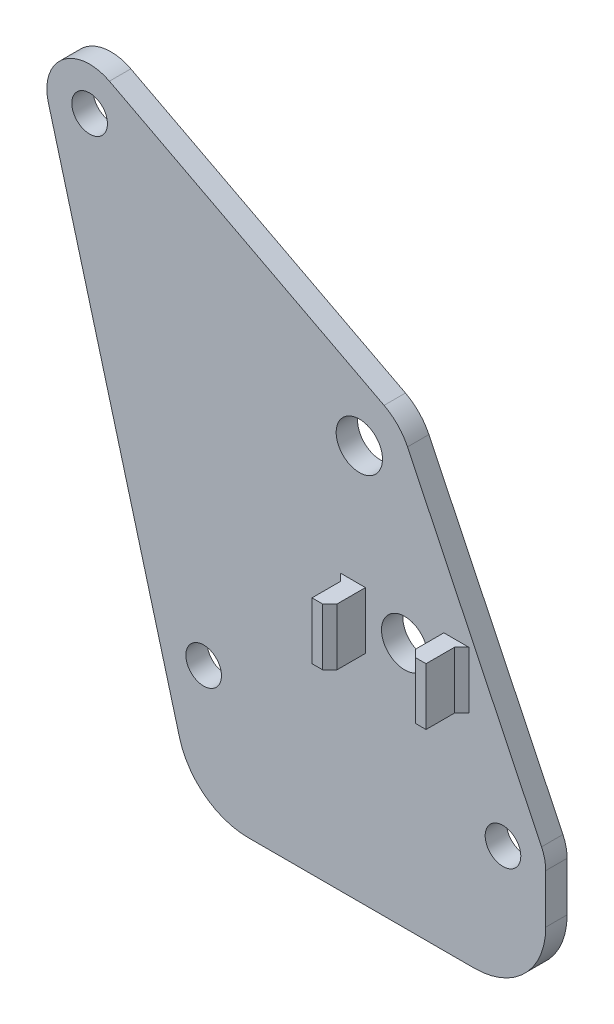
ISO-10303-21;
HEADER;
FILE_DESCRIPTION(('STEP AP214'),'2;1');
FILE_NAME('part.step','',(''),(''),'','','');
FILE_SCHEMA(('AUTOMOTIVE_DESIGN { 1 0 10303 214 1 1 1 1 }'));
ENDSEC;
DATA;
#1=APPLICATION_CONTEXT('core data for automotive mechanical design processes');
#2=APPLICATION_PROTOCOL_DEFINITION('international standard','automotive_design',2000,#1);
#3=PRODUCT_CONTEXT('',#1,'mechanical');
#4=PRODUCT('Part','Part','',(#3));
#5=PRODUCT_RELATED_PRODUCT_CATEGORY('part','',(#4));
#6=PRODUCT_DEFINITION_FORMATION('','',#4);
#7=PRODUCT_DEFINITION_CONTEXT('part definition',#1,'design');
#8=PRODUCT_DEFINITION('design','',#6,#7);
#9=PRODUCT_DEFINITION_SHAPE('','',#8);
#10=(LENGTH_UNIT() NAMED_UNIT(*) SI_UNIT(.MILLI.,.METRE.));
#11=(NAMED_UNIT(*) PLANE_ANGLE_UNIT() SI_UNIT($,.RADIAN.));
#12=(NAMED_UNIT(*) SI_UNIT($,.STERADIAN.) SOLID_ANGLE_UNIT());
#13=UNCERTAINTY_MEASURE_WITH_UNIT(LENGTH_MEASURE(1.E-05),#10,'distance_accuracy_value','');
#14=(GEOMETRIC_REPRESENTATION_CONTEXT(3) GLOBAL_UNCERTAINTY_ASSIGNED_CONTEXT((#13)) GLOBAL_UNIT_ASSIGNED_CONTEXT((#10,
#11,#12)) REPRESENTATION_CONTEXT('',''));
#15=CARTESIAN_POINT('',(0.,0.,0.));
#16=DIRECTION('',(0.,0.,1.));
#17=DIRECTION('',(1.,0.,0.));
#18=AXIS2_PLACEMENT_3D('',#15,#16,#17);
#19=CARTESIAN_POINT('',(-58.,60.,3.));
#20=DIRECTION('',(0.,0.,-1.));
#21=DIRECTION('',(-1.,0.,0.));
#22=AXIS2_PLACEMENT_3D('',#19,#20,#21);
#23=PLANE('',#22);
#24=DIRECTION('',(-1.,0.,0.));
#25=VECTOR('',#24,1.);
#26=CARTESIAN_POINT('',(-8.29852756095151,21.7480131570888,3.));
#27=LINE('',#26,#25);
#28=CARTESIAN_POINT('',(-4.79852756095151,21.7480131570888,3.));
#29=VERTEX_POINT('',#28);
#30=CARTESIAN_POINT('',(-8.29852756095151,21.7480131570888,3.));
#31=VERTEX_POINT('',#30);
#32=EDGE_CURVE('E223',#29,#31,#27,.T.);
#33=ORIENTED_EDGE('',*,*,#32,.F.);
#34=DIRECTION('',(0.,-1.,0.));
#35=VECTOR('',#34,1.);
#36=CARTESIAN_POINT('',(-4.79852756095151,13.7480131570888,3.));
#37=LINE('',#36,#35);
#38=CARTESIAN_POINT('',(-4.79852756095151,13.7480131570888,3.));
#39=VERTEX_POINT('',#38);
#40=EDGE_CURVE('E402',#29,#39,#37,.T.);
#41=ORIENTED_EDGE('',*,*,#40,.T.);
#42=DIRECTION('',(1.,0.,0.));
#43=VECTOR('',#42,1.);
#44=CARTESIAN_POINT('',(-5.79852756095151,13.7480131570888,3.));
#45=LINE('',#44,#43);
#46=CARTESIAN_POINT('',(-8.29852756095151,13.7480131570888,3.));
#47=VERTEX_POINT('',#46);
#48=EDGE_CURVE('E219',#47,#39,#45,.T.);
#49=ORIENTED_EDGE('',*,*,#48,.F.);
#50=DIRECTION('',(0.,-1.,0.));
#51=VECTOR('',#50,1.);
#52=CARTESIAN_POINT('',(-8.29852756095151,21.7480131570888,3.));
#53=LINE('',#52,#51);
#54=EDGE_CURVE('E233',#31,#47,#53,.T.);
#55=ORIENTED_EDGE('',*,*,#54,.F.);
#56=EDGE_LOOP('',(#33,#41,#49,#55));
#57=FACE_BOUND('',#56,.T.);
#58=DIRECTION('',(0.261440011704001,-0.965219726425135,0.));
#59=VECTOR('',#58,1.);
#60=CARTESIAN_POINT('',(-63.7913183585508,58.431359929776,3.));
#61=LINE('',#60,#59);
#62=CARTESIAN_POINT('',(-63.7913183585508,58.431359929776,3.));
#63=VERTEX_POINT('',#62);
#64=CARTESIAN_POINT('',(-45.396059940861,-9.48275230467717,3.));
#65=VERTEX_POINT('',#64);
#66=EDGE_CURVE('E305',#63,#65,#61,.T.);
#67=ORIENTED_EDGE('',*,*,#66,.T.);
#68=CARTESIAN_POINT('',(-35.7438626766096,-6.86835218763717,3.));
#69=DIRECTION('',(0.,0.,-1.));
#70=DIRECTION('',(-1.,0.,0.));
#71=AXIS2_PLACEMENT_3D('',#68,#69,#70);
#72=CIRCLE('',#71,10.);
#73=CARTESIAN_POINT('',(-35.7438626766096,-16.8683521876372,3.));
#74=VERTEX_POINT('',#73);
#75=EDGE_CURVE('E47',#65,#74,#72,.F.);
#76=ORIENTED_EDGE('',*,*,#75,.T.);
#77=DIRECTION('',(1.,0.,0.));
#78=VECTOR('',#77,1.);
#79=CARTESIAN_POINT('',(-43.3955917915065,-16.8683521876372,3.));
#80=LINE('',#79,#78);
#81=CARTESIAN_POINT('',(-4.,-16.8683521876372,3.));
#82=VERTEX_POINT('',#81);
#83=EDGE_CURVE('E309',#74,#82,#80,.T.);
#84=ORIENTED_EDGE('',*,*,#83,.T.);
#85=CARTESIAN_POINT('',(-4.,-6.86835218763716,3.));
#86=DIRECTION('',(0.,0.,-1.));
#87=DIRECTION('',(-1.,0.,0.));
#88=AXIS2_PLACEMENT_3D('',#85,#86,#87);
#89=CIRCLE('',#88,10.);
#90=CARTESIAN_POINT('',(6.,-6.86835218763716,3.));
#91=VERTEX_POINT('',#90);
#92=EDGE_CURVE('E54',#82,#91,#89,.F.);
#93=ORIENTED_EDGE('',*,*,#92,.T.);
#94=DIRECTION('',(0.,1.,0.));
#95=VECTOR('',#94,1.);
#96=CARTESIAN_POINT('',(6.,0.,3.));
#97=LINE('',#96,#95);
#98=CARTESIAN_POINT('',(6.,0.,3.));
#99=VERTEX_POINT('',#98);
#100=EDGE_CURVE('E312',#91,#99,#97,.T.);
#101=ORIENTED_EDGE('',*,*,#100,.T.);
#102=CARTESIAN_POINT('',(0.,0.,3.));
#103=DIRECTION('',(0.,0.,1.));
#104=DIRECTION('',(-1.,0.,0.));
#105=AXIS2_PLACEMENT_3D('',#102,#103,#104);
#106=CIRCLE('',#105,6.);
#107=CARTESIAN_POINT('',(5.4096285675306,2.59536486093127,3.));
#108=VERTEX_POINT('',#107);
#109=EDGE_CURVE('E315',#99,#108,#106,.T.);
#110=ORIENTED_EDGE('',*,*,#109,.T.);
#111=DIRECTION('',(-0.432560810155212,0.9016047612551,0.));
#112=VECTOR('',#111,1.);
#113=CARTESIAN_POINT('',(-13.3955764292577,41.7918476754489,3.));
#114=LINE('',#113,#112);
#115=CARTESIAN_POINT('',(-13.3955764292577,41.7918476754489,3.));
#116=VERTEX_POINT('',#115);
#117=EDGE_CURVE('E318',#108,#116,#114,.T.);
#118=ORIENTED_EDGE('',*,*,#117,.T.);
#119=CARTESIAN_POINT('',(-20.157612138671,38.5476415992848,3.));
#120=DIRECTION('',(0.,0.,1.));
#121=DIRECTION('',(-1.,0.,0.));
#122=AXIS2_PLACEMENT_3D('',#119,#120,#121);
#123=CIRCLE('',#122,7.5);
#124=CARTESIAN_POINT('',(-16.6861137587854,45.195851809443,3.));
#125=VERTEX_POINT('',#124);
#126=EDGE_CURVE('E321',#116,#125,#123,.T.);
#127=ORIENTED_EDGE('',*,*,#126,.T.);
#128=DIRECTION('',(-0.88642802802109,0.462866450651418,0.));
#129=VECTOR('',#128,1.);
#130=CARTESIAN_POINT('',(-55.2228012960915,65.3185681681265,3.));
#131=LINE('',#130,#129);
#132=CARTESIAN_POINT('',(-55.2228012960915,65.3185681681265,3.));
#133=VERTEX_POINT('',#132);
#134=EDGE_CURVE('E324',#125,#133,#131,.T.);
#135=ORIENTED_EDGE('',*,*,#134,.T.);
#136=CARTESIAN_POINT('',(-58.,60.,3.));
#137=DIRECTION('',(0.,0.,1.));
#138=DIRECTION('',(-1.,0.,0.));
#139=AXIS2_PLACEMENT_3D('',#136,#137,#138);
#140=CIRCLE('',#139,6.);
#141=EDGE_CURVE('E301',#133,#63,#140,.T.);
#142=ORIENTED_EDGE('',*,*,#141,.T.);
#143=EDGE_LOOP('',(#67,#76,#84,#93,#101,#110,#118,#127,#135,#142));
#144=FACE_BOUND('',#143,.T.);
#145=CARTESIAN_POINT('',(0.,0.,3.));
#146=DIRECTION('',(0.,0.,1.));
#147=DIRECTION('',(1.,0.,0.));
#148=AXIS2_PLACEMENT_3D('',#145,#146,#147);
#149=CIRCLE('',#148,2.5);
#150=CARTESIAN_POINT('',(2.5,0.,3.));
#151=VERTEX_POINT('',#150);
#152=EDGE_CURVE('E293',#151,#151,#149,.T.);
#153=ORIENTED_EDGE('',*,*,#152,.F.);
#154=EDGE_LOOP('',(#153));
#155=FACE_BOUND('',#154,.T.);
#156=CARTESIAN_POINT('',(-58.,60.,3.));
#157=DIRECTION('',(0.,0.,1.));
#158=DIRECTION('',(1.,0.,0.));
#159=AXIS2_PLACEMENT_3D('',#156,#157,#158);
#160=CIRCLE('',#159,2.50000000000001);
#161=CARTESIAN_POINT('',(-55.5,60.,3.));
#162=VERTEX_POINT('',#161);
#163=EDGE_CURVE('E285',#162,#162,#160,.T.);
#164=ORIENTED_EDGE('',*,*,#163,.F.);
#165=EDGE_LOOP('',(#164));
#166=FACE_BOUND('',#165,.T.);
#167=CARTESIAN_POINT('',(-41.9999999999999,0.9290279550359,3.));
#168=DIRECTION('',(0.,0.,1.));
#169=DIRECTION('',(1.,0.,0.));
#170=AXIS2_PLACEMENT_3D('',#167,#168,#169);
#171=CIRCLE('',#170,2.49999999999987);
#172=CARTESIAN_POINT('',(-39.5000000000001,0.9290279550359,3.));
#173=VERTEX_POINT('',#172);
#174=EDGE_CURVE('E277',#173,#173,#171,.T.);
#175=ORIENTED_EDGE('',*,*,#174,.F.);
#176=EDGE_LOOP('',(#175));
#177=FACE_BOUND('',#176,.T.);
#178=CARTESIAN_POINT('',(-20.157612138671,38.5476415992848,3.));
#179=DIRECTION('',(0.,0.,1.));
#180=DIRECTION('',(1.,0.,0.));
#181=AXIS2_PLACEMENT_3D('',#178,#179,#180);
#182=CIRCLE('',#181,3.24999999999987);
#183=CARTESIAN_POINT('',(-16.9076121386711,38.5476415992848,3.));
#184=VERTEX_POINT('',#183);
#185=EDGE_CURVE('E269',#184,#184,#182,.T.);
#186=ORIENTED_EDGE('',*,*,#185,.F.);
#187=EDGE_LOOP('',(#186));
#188=FACE_BOUND('',#187,.T.);
#189=CARTESIAN_POINT('',(-13.7985275609515,17.7480131570888,3.));
#190=DIRECTION('',(0.,0.,1.));
#191=DIRECTION('',(1.,0.,0.));
#192=AXIS2_PLACEMENT_3D('',#189,#190,#191);
#193=CIRCLE('',#192,3.24999999999987);
#194=CARTESIAN_POINT('',(-10.5485275609516,17.7480131570888,3.));
#195=VERTEX_POINT('',#194);
#196=EDGE_CURVE('E261',#195,#195,#193,.T.);
#197=ORIENTED_EDGE('',*,*,#196,.F.);
#198=EDGE_LOOP('',(#197));
#199=FACE_BOUND('',#198,.T.);
#200=DIRECTION('',(1.,0.,0.));
#201=VECTOR('',#200,1.);
#202=CARTESIAN_POINT('',(-19.2985275609515,13.7480131570888,3.));
#203=LINE('',#202,#201);
#204=CARTESIAN_POINT('',(-22.7985275609515,13.7480131570888,3.));
#205=VERTEX_POINT('',#204);
#206=CARTESIAN_POINT('',(-19.2985275609515,13.7480131570888,3.));
#207=VERTEX_POINT('',#206);
#208=EDGE_CURVE('E607',#205,#207,#203,.T.);
#209=ORIENTED_EDGE('',*,*,#208,.F.);
#210=DIRECTION('',(0.,1.,0.));
#211=VECTOR('',#210,1.);
#212=CARTESIAN_POINT('',(-22.7985275609515,21.7480131570888,3.));
#213=LINE('',#212,#211);
#214=CARTESIAN_POINT('',(-22.7985275609515,21.7480131570888,3.));
#215=VERTEX_POINT('',#214);
#216=EDGE_CURVE('E406',#205,#215,#213,.T.);
#217=ORIENTED_EDGE('',*,*,#216,.T.);
#218=DIRECTION('',(-1.,0.,0.));
#219=VECTOR('',#218,1.);
#220=CARTESIAN_POINT('',(-21.7985275609515,21.7480131570888,3.));
#221=LINE('',#220,#219);
#222=CARTESIAN_POINT('',(-19.2985275609515,21.7480131570888,3.));
#223=VERTEX_POINT('',#222);
#224=EDGE_CURVE('E614',#223,#215,#221,.T.);
#225=ORIENTED_EDGE('',*,*,#224,.F.);
#226=DIRECTION('',(0.,1.,0.));
#227=VECTOR('',#226,1.);
#228=CARTESIAN_POINT('',(-19.2985275609515,21.7480131570888,3.));
#229=LINE('',#228,#227);
#230=EDGE_CURVE('E201',#207,#223,#229,.T.);
#231=ORIENTED_EDGE('',*,*,#230,.F.);
#232=EDGE_LOOP('',(#209,#217,#225,#231));
#233=FACE_BOUND('',#232,.T.);
#234=ADVANCED_FACE('F38',(#57,#144,#155,#166,#177,#188,#199,#233),#23,.F.);
#235=CARTESIAN_POINT('',(-58.,60.,0.));
#236=DIRECTION('',(0.,0.,-1.));
#237=DIRECTION('',(-1.,0.,0.));
#238=AXIS2_PLACEMENT_3D('',#235,#236,#237);
#239=PLANE('',#238);
#240=CARTESIAN_POINT('',(-20.157612138671,38.5476415992848,0.));
#241=DIRECTION('',(0.,0.,1.));
#242=DIRECTION('',(1.,0.,0.));
#243=AXIS2_PLACEMENT_3D('',#240,#241,#242);
#244=CIRCLE('',#243,3.24999999999987);
#245=CARTESIAN_POINT('',(-16.9076121386711,38.5476415992848,0.));
#246=VERTEX_POINT('',#245);
#247=EDGE_CURVE('E265',#246,#246,#244,.T.);
#248=ORIENTED_EDGE('',*,*,#247,.T.);
#249=EDGE_LOOP('',(#248));
#250=FACE_BOUND('',#249,.T.);
#251=CARTESIAN_POINT('',(-58.,60.,0.));
#252=DIRECTION('',(0.,0.,1.));
#253=DIRECTION('',(1.,0.,0.));
#254=AXIS2_PLACEMENT_3D('',#251,#252,#253);
#255=CIRCLE('',#254,2.50000000000001);
#256=CARTESIAN_POINT('',(-55.5,60.,0.));
#257=VERTEX_POINT('',#256);
#258=EDGE_CURVE('E281',#257,#257,#255,.T.);
#259=ORIENTED_EDGE('',*,*,#258,.T.);
#260=EDGE_LOOP('',(#259));
#261=FACE_BOUND('',#260,.T.);
#262=DIRECTION('',(1.,0.,0.));
#263=VECTOR('',#262,1.);
#264=CARTESIAN_POINT('',(-43.3955917915065,-16.8683521876372,0.));
#265=LINE('',#264,#263);
#266=CARTESIAN_POINT('',(-35.7438626766096,-16.8683521876372,0.));
#267=VERTEX_POINT('',#266);
#268=CARTESIAN_POINT('',(-4.,-16.8683521876372,0.));
#269=VERTEX_POINT('',#268);
#270=EDGE_CURVE('E334',#267,#269,#265,.T.);
#271=ORIENTED_EDGE('',*,*,#270,.F.);
#272=CARTESIAN_POINT('',(-35.7438626766096,-6.86835218763717,0.));
#273=DIRECTION('',(0.,0.,-1.));
#274=DIRECTION('',(-1.,0.,0.));
#275=AXIS2_PLACEMENT_3D('',#272,#273,#274);
#276=CIRCLE('',#275,10.);
#277=CARTESIAN_POINT('',(-45.396059940861,-9.48275230467717,0.));
#278=VERTEX_POINT('',#277);
#279=EDGE_CURVE('E437',#267,#278,#276,.T.);
#280=ORIENTED_EDGE('',*,*,#279,.T.);
#281=DIRECTION('',(0.261440011704001,-0.965219726425135,0.));
#282=VECTOR('',#281,1.);
#283=CARTESIAN_POINT('',(-63.7913183585508,58.431359929776,0.));
#284=LINE('',#283,#282);
#285=CARTESIAN_POINT('',(-63.7913183585508,58.431359929776,0.));
#286=VERTEX_POINT('',#285);
#287=EDGE_CURVE('E331',#286,#278,#284,.T.);
#288=ORIENTED_EDGE('',*,*,#287,.F.);
#289=CARTESIAN_POINT('',(-58.,60.,0.));
#290=DIRECTION('',(0.,0.,1.));
#291=DIRECTION('',(-1.,0.,0.));
#292=AXIS2_PLACEMENT_3D('',#289,#290,#291);
#293=CIRCLE('',#292,6.);
#294=CARTESIAN_POINT('',(-55.2228012960915,65.3185681681265,0.));
#295=VERTEX_POINT('',#294);
#296=EDGE_CURVE('E297',#295,#286,#293,.T.);
#297=ORIENTED_EDGE('',*,*,#296,.F.);
#298=DIRECTION('',(-0.88642802802109,0.462866450651418,0.));
#299=VECTOR('',#298,1.);
#300=CARTESIAN_POINT('',(-55.2228012960915,65.3185681681265,0.));
#301=LINE('',#300,#299);
#302=CARTESIAN_POINT('',(-16.6861137587854,45.195851809443,0.));
#303=VERTEX_POINT('',#302);
#304=EDGE_CURVE('E306',#303,#295,#301,.T.);
#305=ORIENTED_EDGE('',*,*,#304,.F.);
#306=CARTESIAN_POINT('',(-20.157612138671,38.5476415992848,0.));
#307=DIRECTION('',(0.,0.,1.));
#308=DIRECTION('',(-1.,0.,0.));
#309=AXIS2_PLACEMENT_3D('',#306,#307,#308);
#310=CIRCLE('',#309,7.5);
#311=CARTESIAN_POINT('',(-13.3955764292577,41.7918476754489,0.));
#312=VERTEX_POINT('',#311);
#313=EDGE_CURVE('E347',#312,#303,#310,.T.);
#314=ORIENTED_EDGE('',*,*,#313,.F.);
#315=DIRECTION('',(-0.432560810155212,0.9016047612551,0.));
#316=VECTOR('',#315,1.);
#317=CARTESIAN_POINT('',(-13.3955764292577,41.7918476754489,0.));
#318=LINE('',#317,#316);
#319=CARTESIAN_POINT('',(5.4096285675306,2.59536486093127,0.));
#320=VERTEX_POINT('',#319);
#321=EDGE_CURVE('E344',#320,#312,#318,.T.);
#322=ORIENTED_EDGE('',*,*,#321,.F.);
#323=CARTESIAN_POINT('',(0.,0.,0.));
#324=DIRECTION('',(0.,0.,1.));
#325=DIRECTION('',(-1.,0.,0.));
#326=AXIS2_PLACEMENT_3D('',#323,#324,#325);
#327=CIRCLE('',#326,6.);
#328=CARTESIAN_POINT('',(6.,0.,0.));
#329=VERTEX_POINT('',#328);
#330=EDGE_CURVE('E341',#329,#320,#327,.T.);
#331=ORIENTED_EDGE('',*,*,#330,.F.);
#332=DIRECTION('',(0.,1.,0.));
#333=VECTOR('',#332,1.);
#334=CARTESIAN_POINT('',(6.,0.,0.));
#335=LINE('',#334,#333);
#336=CARTESIAN_POINT('',(6.,-6.86835218763716,0.));
#337=VERTEX_POINT('',#336);
#338=EDGE_CURVE('E338',#337,#329,#335,.T.);
#339=ORIENTED_EDGE('',*,*,#338,.F.);
#340=CARTESIAN_POINT('',(-4.,-6.86835218763716,0.));
#341=DIRECTION('',(0.,0.,-1.));
#342=DIRECTION('',(-1.,0.,0.));
#343=AXIS2_PLACEMENT_3D('',#340,#341,#342);
#344=CIRCLE('',#343,10.);
#345=EDGE_CURVE('E434',#337,#269,#344,.T.);
#346=ORIENTED_EDGE('',*,*,#345,.T.);
#347=EDGE_LOOP('',(#271,#280,#288,#297,#305,#314,#322,#331,#339,#346));
#348=FACE_BOUND('',#347,.T.);
#349=CARTESIAN_POINT('',(0.,0.,0.));
#350=DIRECTION('',(0.,0.,1.));
#351=DIRECTION('',(1.,0.,0.));
#352=AXIS2_PLACEMENT_3D('',#349,#350,#351);
#353=CIRCLE('',#352,2.5);
#354=CARTESIAN_POINT('',(2.5,0.,0.));
#355=VERTEX_POINT('',#354);
#356=EDGE_CURVE('E289',#355,#355,#353,.T.);
#357=ORIENTED_EDGE('',*,*,#356,.T.);
#358=EDGE_LOOP('',(#357));
#359=FACE_BOUND('',#358,.T.);
#360=CARTESIAN_POINT('',(-41.9999999999999,0.9290279550359,0.));
#361=DIRECTION('',(0.,0.,1.));
#362=DIRECTION('',(1.,0.,0.));
#363=AXIS2_PLACEMENT_3D('',#360,#361,#362);
#364=CIRCLE('',#363,2.49999999999987);
#365=CARTESIAN_POINT('',(-39.5000000000001,0.9290279550359,0.));
#366=VERTEX_POINT('',#365);
#367=EDGE_CURVE('E273',#366,#366,#364,.T.);
#368=ORIENTED_EDGE('',*,*,#367,.T.);
#369=EDGE_LOOP('',(#368));
#370=FACE_BOUND('',#369,.T.);
#371=CARTESIAN_POINT('',(-13.7985275609515,17.7480131570888,0.));
#372=DIRECTION('',(0.,0.,1.));
#373=DIRECTION('',(1.,0.,0.));
#374=AXIS2_PLACEMENT_3D('',#371,#372,#373);
#375=CIRCLE('',#374,3.24999999999987);
#376=CARTESIAN_POINT('',(-10.5485275609516,17.7480131570888,0.));
#377=VERTEX_POINT('',#376);
#378=EDGE_CURVE('E260',#377,#377,#375,.T.);
#379=ORIENTED_EDGE('',*,*,#378,.T.);
#380=EDGE_LOOP('',(#379));
#381=FACE_BOUND('',#380,.T.);
#382=ADVANCED_FACE('F455',(#250,#261,#348,#359,#370,#381),#239,.T.);
#383=CARTESIAN_POINT('',(-58.,60.,3.));
#384=DIRECTION('',(0.,0.,-1.));
#385=DIRECTION('',(-1.,0.,0.));
#386=AXIS2_PLACEMENT_3D('',#383,#384,#385);
#387=CYLINDRICAL_SURFACE('',#386,6.);
#388=ORIENTED_EDGE('',*,*,#296,.T.);
#389=DIRECTION('',(0.,0.,-1.));
#390=VECTOR('',#389,1.);
#391=CARTESIAN_POINT('',(-63.7913183585508,58.431359929776,3.));
#392=LINE('',#391,#390);
#393=EDGE_CURVE('E371',#63,#286,#392,.T.);
#394=ORIENTED_EDGE('',*,*,#393,.F.);
#395=ORIENTED_EDGE('',*,*,#141,.F.);
#396=DIRECTION('',(0.,0.,-1.));
#397=VECTOR('',#396,1.);
#398=CARTESIAN_POINT('',(-55.2228012960915,65.3185681681265,3.));
#399=LINE('',#398,#397);
#400=EDGE_CURVE('E327',#133,#295,#399,.T.);
#401=ORIENTED_EDGE('',*,*,#400,.T.);
#402=EDGE_LOOP('',(#388,#394,#395,#401));
#403=FACE_BOUND('',#402,.T.);
#404=ADVANCED_FACE('F462',(#403),#387,.T.);
#405=CARTESIAN_POINT('',(-63.7913183585508,58.431359929776,3.));
#406=DIRECTION('',(0.965219726425135,0.261440011704001,0.));
#407=DIRECTION('',(-0.261440011704001,0.965219726425135,0.));
#408=AXIS2_PLACEMENT_3D('',#405,#406,#407);
#409=PLANE('',#408);
#410=ORIENTED_EDGE('',*,*,#287,.T.);
#411=DIRECTION('',(0.,0.,-1.));
#412=VECTOR('',#411,1.);
#413=CARTESIAN_POINT('',(-45.396059940861,-9.48275230467717,3.));
#414=LINE('',#413,#412);
#415=EDGE_CURVE('E62',#278,#65,#414,.F.);
#416=ORIENTED_EDGE('',*,*,#415,.T.);
#417=ORIENTED_EDGE('',*,*,#66,.F.);
#418=ORIENTED_EDGE('',*,*,#393,.T.);
#419=EDGE_LOOP('',(#410,#416,#417,#418));
#420=FACE_BOUND('',#419,.T.);
#421=ADVANCED_FACE('F458',(#420),#409,.F.);
#422=CARTESIAN_POINT('',(-43.3955917915065,-16.8683521876372,3.));
#423=DIRECTION('',(0.,1.,0.));
#424=DIRECTION('',(-1.,0.,0.));
#425=AXIS2_PLACEMENT_3D('',#422,#423,#424);
#426=PLANE('',#425);
#427=ORIENTED_EDGE('',*,*,#83,.F.);
#428=DIRECTION('',(0.,0.,-1.));
#429=VECTOR('',#428,1.);
#430=CARTESIAN_POINT('',(-35.7438626766096,-16.8683521876372,3.));
#431=LINE('',#430,#429);
#432=EDGE_CURVE('E430',#74,#267,#431,.T.);
#433=ORIENTED_EDGE('',*,*,#432,.T.);
#434=ORIENTED_EDGE('',*,*,#270,.T.);
#435=DIRECTION('',(0.,0.,-1.));
#436=VECTOR('',#435,1.);
#437=CARTESIAN_POINT('',(-4.,-16.8683521876372,3.));
#438=LINE('',#437,#436);
#439=EDGE_CURVE('E427',#269,#82,#438,.F.);
#440=ORIENTED_EDGE('',*,*,#439,.T.);
#441=EDGE_LOOP('',(#427,#433,#434,#440));
#442=FACE_BOUND('',#441,.T.);
#443=ADVANCED_FACE('F450',(#442),#426,.F.);
#444=CARTESIAN_POINT('',(6.,0.,3.));
#445=DIRECTION('',(-1.,0.,0.));
#446=DIRECTION('',(0.,-1.,0.));
#447=AXIS2_PLACEMENT_3D('',#444,#445,#446);
#448=PLANE('',#447);
#449=ORIENTED_EDGE('',*,*,#100,.F.);
#450=DIRECTION('',(0.,0.,-1.));
#451=VECTOR('',#450,1.);
#452=CARTESIAN_POINT('',(6.,-6.86835218763716,3.));
#453=LINE('',#452,#451);
#454=EDGE_CURVE('E11',#91,#337,#453,.T.);
#455=ORIENTED_EDGE('',*,*,#454,.T.);
#456=ORIENTED_EDGE('',*,*,#338,.T.);
#457=DIRECTION('',(0.,0.,-1.));
#458=VECTOR('',#457,1.);
#459=CARTESIAN_POINT('',(6.,0.,3.));
#460=LINE('',#459,#458);
#461=EDGE_CURVE('E367',#99,#329,#460,.T.);
#462=ORIENTED_EDGE('',*,*,#461,.F.);
#463=EDGE_LOOP('',(#449,#455,#456,#462));
#464=FACE_BOUND('',#463,.T.);
#465=ADVANCED_FACE('F486',(#464),#448,.F.);
#466=CARTESIAN_POINT('',(0.,0.,3.));
#467=DIRECTION('',(0.,0.,-1.));
#468=DIRECTION('',(-1.,0.,0.));
#469=AXIS2_PLACEMENT_3D('',#466,#467,#468);
#470=CYLINDRICAL_SURFACE('',#469,6.);
#471=ORIENTED_EDGE('',*,*,#330,.T.);
#472=DIRECTION('',(0.,0.,-1.));
#473=VECTOR('',#472,1.);
#474=CARTESIAN_POINT('',(5.4096285675306,2.59536486093127,3.));
#475=LINE('',#474,#473);
#476=EDGE_CURVE('E363',#108,#320,#475,.T.);
#477=ORIENTED_EDGE('',*,*,#476,.F.);
#478=ORIENTED_EDGE('',*,*,#109,.F.);
#479=ORIENTED_EDGE('',*,*,#461,.T.);
#480=EDGE_LOOP('',(#471,#477,#478,#479));
#481=FACE_BOUND('',#480,.T.);
#482=ADVANCED_FACE('F482',(#481),#470,.T.);
#483=CARTESIAN_POINT('',(-13.3955764292577,41.7918476754489,3.));
#484=DIRECTION('',(-0.9016047612551,-0.432560810155212,0.));
#485=DIRECTION('',(0.432560810155212,-0.9016047612551,0.));
#486=AXIS2_PLACEMENT_3D('',#483,#484,#485);
#487=PLANE('',#486);
#488=ORIENTED_EDGE('',*,*,#321,.T.);
#489=DIRECTION('',(0.,0.,-1.));
#490=VECTOR('',#489,1.);
#491=CARTESIAN_POINT('',(-13.3955764292577,41.7918476754489,3.));
#492=LINE('',#491,#490);
#493=EDGE_CURVE('E359',#116,#312,#492,.T.);
#494=ORIENTED_EDGE('',*,*,#493,.F.);
#495=ORIENTED_EDGE('',*,*,#117,.F.);
#496=ORIENTED_EDGE('',*,*,#476,.T.);
#497=EDGE_LOOP('',(#488,#494,#495,#496));
#498=FACE_BOUND('',#497,.T.);
#499=ADVANCED_FACE('F477',(#498),#487,.F.);
#500=CARTESIAN_POINT('',(-20.157612138671,38.5476415992848,3.));
#501=DIRECTION('',(0.,0.,-1.));
#502=DIRECTION('',(-1.,0.,0.));
#503=AXIS2_PLACEMENT_3D('',#500,#501,#502);
#504=CYLINDRICAL_SURFACE('',#503,7.5);
#505=ORIENTED_EDGE('',*,*,#313,.T.);
#506=DIRECTION('',(0.,0.,-1.));
#507=VECTOR('',#506,1.);
#508=CARTESIAN_POINT('',(-16.6861137587854,45.195851809443,3.));
#509=LINE('',#508,#507);
#510=EDGE_CURVE('E355',#125,#303,#509,.T.);
#511=ORIENTED_EDGE('',*,*,#510,.F.);
#512=ORIENTED_EDGE('',*,*,#126,.F.);
#513=ORIENTED_EDGE('',*,*,#493,.T.);
#514=EDGE_LOOP('',(#505,#511,#512,#513));
#515=FACE_BOUND('',#514,.T.);
#516=ADVANCED_FACE('F473',(#515),#504,.T.);
#517=CARTESIAN_POINT('',(-55.2228012960915,65.3185681681265,3.));
#518=DIRECTION('',(-0.462866450651418,-0.88642802802109,0.));
#519=DIRECTION('',(0.88642802802109,-0.462866450651418,0.));
#520=AXIS2_PLACEMENT_3D('',#517,#518,#519);
#521=PLANE('',#520);
#522=ORIENTED_EDGE('',*,*,#304,.T.);
#523=ORIENTED_EDGE('',*,*,#400,.F.);
#524=ORIENTED_EDGE('',*,*,#134,.F.);
#525=ORIENTED_EDGE('',*,*,#510,.T.);
#526=EDGE_LOOP('',(#522,#523,#524,#525));
#527=FACE_BOUND('',#526,.T.);
#528=ADVANCED_FACE('F468',(#527),#521,.F.);
#529=CARTESIAN_POINT('',(0.,0.,3.));
#530=DIRECTION('',(0.,0.,-1.));
#531=DIRECTION('',(-1.,0.,0.));
#532=AXIS2_PLACEMENT_3D('',#529,#530,#531);
#533=CYLINDRICAL_SURFACE('',#532,2.5);
#534=ORIENTED_EDGE('',*,*,#152,.T.);
#535=EDGE_LOOP('',(#534));
#536=FACE_BOUND('',#535,.T.);
#537=ORIENTED_EDGE('',*,*,#356,.F.);
#538=EDGE_LOOP('',(#537));
#539=FACE_BOUND('',#538,.T.);
#540=ADVANCED_FACE('F504',(#536,#539),#533,.F.);
#541=CARTESIAN_POINT('',(-58.,60.,3.));
#542=DIRECTION('',(0.,0.,-1.));
#543=DIRECTION('',(-1.,0.,0.));
#544=AXIS2_PLACEMENT_3D('',#541,#542,#543);
#545=CYLINDRICAL_SURFACE('',#544,2.50000000000001);
#546=ORIENTED_EDGE('',*,*,#163,.T.);
#547=EDGE_LOOP('',(#546));
#548=FACE_BOUND('',#547,.T.);
#549=ORIENTED_EDGE('',*,*,#258,.F.);
#550=EDGE_LOOP('',(#549));
#551=FACE_BOUND('',#550,.T.);
#552=ADVANCED_FACE('F585',(#548,#551),#545,.F.);
#553=CARTESIAN_POINT('',(-41.9999999999999,0.9290279550359,3.));
#554=DIRECTION('',(0.,0.,-1.));
#555=DIRECTION('',(-1.,0.,0.));
#556=AXIS2_PLACEMENT_3D('',#553,#554,#555);
#557=CYLINDRICAL_SURFACE('',#556,2.49999999999987);
#558=ORIENTED_EDGE('',*,*,#174,.T.);
#559=EDGE_LOOP('',(#558));
#560=FACE_BOUND('',#559,.T.);
#561=ORIENTED_EDGE('',*,*,#367,.F.);
#562=EDGE_LOOP('',(#561));
#563=FACE_BOUND('',#562,.T.);
#564=ADVANCED_FACE('F582',(#560,#563),#557,.F.);
#565=CARTESIAN_POINT('',(-20.157612138671,38.5476415992848,3.));
#566=DIRECTION('',(0.,0.,-1.));
#567=DIRECTION('',(-1.,0.,0.));
#568=AXIS2_PLACEMENT_3D('',#565,#566,#567);
#569=CYLINDRICAL_SURFACE('',#568,3.24999999999987);
#570=ORIENTED_EDGE('',*,*,#185,.T.);
#571=EDGE_LOOP('',(#570));
#572=FACE_BOUND('',#571,.T.);
#573=ORIENTED_EDGE('',*,*,#247,.F.);
#574=EDGE_LOOP('',(#573));
#575=FACE_BOUND('',#574,.T.);
#576=ADVANCED_FACE('F578',(#572,#575),#569,.F.);
#577=CARTESIAN_POINT('',(-13.7985275609515,17.7480131570888,3.));
#578=DIRECTION('',(0.,0.,-1.));
#579=DIRECTION('',(-1.,0.,0.));
#580=AXIS2_PLACEMENT_3D('',#577,#578,#579);
#581=CYLINDRICAL_SURFACE('',#580,3.24999999999987);
#582=ORIENTED_EDGE('',*,*,#196,.T.);
#583=EDGE_LOOP('',(#582));
#584=FACE_BOUND('',#583,.T.);
#585=ORIENTED_EDGE('',*,*,#378,.F.);
#586=EDGE_LOOP('',(#585));
#587=FACE_BOUND('',#586,.T.);
#588=ADVANCED_FACE('F575',(#584,#587),#581,.F.);
#589=CARTESIAN_POINT('',(-5.79852756095151,13.7480131570888,8.));
#590=DIRECTION('',(0.,1.,0.));
#591=DIRECTION('',(0.,0.,1.));
#592=AXIS2_PLACEMENT_3D('',#589,#590,#591);
#593=PLANE('',#592);
#594=DIRECTION('',(1.,0.,0.));
#595=VECTOR('',#594,1.);
#596=CARTESIAN_POINT('',(-5.79852756095151,13.7480131570888,8.));
#597=LINE('',#596,#595);
#598=CARTESIAN_POINT('',(-7.29852756095154,13.7480131570888,8.));
#599=VERTEX_POINT('',#598);
#600=CARTESIAN_POINT('',(-5.79852756095151,13.7480131570888,8.));
#601=VERTEX_POINT('',#600);
#602=EDGE_CURVE('E229',#599,#601,#597,.T.);
#603=ORIENTED_EDGE('',*,*,#602,.F.);
#604=DIRECTION('',(-0.707106781186543,0.,-0.707106781186552));
#605=VECTOR('',#604,1.);
#606=CARTESIAN_POINT('',(-7.29852756095154,13.7480131570888,8.));
#607=LINE('',#606,#605);
#608=CARTESIAN_POINT('',(-8.29852756095151,13.7480131570888,7.00000000000001));
#609=VERTEX_POINT('',#608);
#610=EDGE_CURVE('E390',#599,#609,#607,.T.);
#611=ORIENTED_EDGE('',*,*,#610,.T.);
#612=DIRECTION('',(0.,0.,-1.));
#613=VECTOR('',#612,1.);
#614=CARTESIAN_POINT('',(-8.29852756095151,13.7480131570888,8.));
#615=LINE('',#614,#613);
#616=EDGE_CURVE('E239',#609,#47,#615,.T.);
#617=ORIENTED_EDGE('',*,*,#616,.T.);
#618=ORIENTED_EDGE('',*,*,#48,.T.);
#619=DIRECTION('',(0.707106781186543,0.,-0.707106781186552));
#620=VECTOR('',#619,1.);
#621=CARTESIAN_POINT('',(-7.79852756095151,13.7480131570888,6.00000000000003));
#622=LINE('',#621,#620);
#623=CARTESIAN_POINT('',(-5.79852756095151,13.7480131570888,4.00000000000002));
#624=VERTEX_POINT('',#623);
#625=EDGE_CURVE('E424',#39,#624,#622,.F.);
#626=ORIENTED_EDGE('',*,*,#625,.T.);
#627=DIRECTION('',(0.,0.,-1.));
#628=VECTOR('',#627,1.);
#629=CARTESIAN_POINT('',(-5.79852756095151,13.7480131570888,8.));
#630=LINE('',#629,#628);
#631=EDGE_CURVE('E256',#601,#624,#630,.T.);
#632=ORIENTED_EDGE('',*,*,#631,.F.);
#633=EDGE_LOOP('',(#603,#611,#617,#618,#626,#632));
#634=FACE_BOUND('',#633,.T.);
#635=ADVANCED_FACE('F544',(#634),#593,.F.);
#636=CARTESIAN_POINT('',(-5.79852756095151,21.7480131570888,8.));
#637=DIRECTION('',(-1.,0.,0.));
#638=DIRECTION('',(0.,0.,1.));
#639=AXIS2_PLACEMENT_3D('',#636,#637,#638);
#640=PLANE('',#639);
#641=ORIENTED_EDGE('',*,*,#631,.T.);
#642=DIRECTION('',(0.,1.,0.));
#643=VECTOR('',#642,1.);
#644=CARTESIAN_POINT('',(-5.79852756095151,21.7480131570888,4.00000000000002));
#645=LINE('',#644,#643);
#646=CARTESIAN_POINT('',(-5.79852756095151,21.7480131570888,4.00000000000002));
#647=VERTEX_POINT('',#646);
#648=EDGE_CURVE('E410',#624,#647,#645,.T.);
#649=ORIENTED_EDGE('',*,*,#648,.T.);
#650=DIRECTION('',(0.,0.,-1.));
#651=VECTOR('',#650,1.);
#652=CARTESIAN_POINT('',(-5.79852756095151,21.7480131570888,8.));
#653=LINE('',#652,#651);
#654=CARTESIAN_POINT('',(-5.79852756095151,21.7480131570888,8.));
#655=VERTEX_POINT('',#654);
#656=EDGE_CURVE('E252',#655,#647,#653,.T.);
#657=ORIENTED_EDGE('',*,*,#656,.F.);
#658=DIRECTION('',(0.,1.,0.));
#659=VECTOR('',#658,1.);
#660=CARTESIAN_POINT('',(-5.79852756095151,21.7480131570888,8.));
#661=LINE('',#660,#659);
#662=EDGE_CURVE('E232',#601,#655,#661,.T.);
#663=ORIENTED_EDGE('',*,*,#662,.F.);
#664=EDGE_LOOP('',(#641,#649,#657,#663));
#665=FACE_BOUND('',#664,.T.);
#666=ADVANCED_FACE('F548',(#665),#640,.F.);
#667=CARTESIAN_POINT('',(-8.29852756095151,21.7480131570888,8.));
#668=DIRECTION('',(0.,-1.,0.));
#669=DIRECTION('',(0.,0.,-1.));
#670=AXIS2_PLACEMENT_3D('',#667,#668,#669);
#671=PLANE('',#670);
#672=DIRECTION('',(0.,0.,-1.));
#673=VECTOR('',#672,1.);
#674=CARTESIAN_POINT('',(-8.29852756095151,21.7480131570888,8.));
#675=LINE('',#674,#673);
#676=CARTESIAN_POINT('',(-8.29852756095151,21.7480131570888,7.00000000000001));
#677=VERTEX_POINT('',#676);
#678=EDGE_CURVE('E249',#677,#31,#675,.T.);
#679=ORIENTED_EDGE('',*,*,#678,.F.);
#680=DIRECTION('',(0.707106781186543,0.,0.707106781186552));
#681=VECTOR('',#680,1.);
#682=CARTESIAN_POINT('',(-7.29852756095154,21.7480131570888,8.));
#683=LINE('',#682,#681);
#684=CARTESIAN_POINT('',(-7.29852756095154,21.7480131570888,8.));
#685=VERTEX_POINT('',#684);
#686=EDGE_CURVE('E396',#677,#685,#683,.T.);
#687=ORIENTED_EDGE('',*,*,#686,.T.);
#688=DIRECTION('',(-1.,0.,0.));
#689=VECTOR('',#688,1.);
#690=CARTESIAN_POINT('',(-8.29852756095151,21.7480131570888,8.));
#691=LINE('',#690,#689);
#692=EDGE_CURVE('E236',#655,#685,#691,.T.);
#693=ORIENTED_EDGE('',*,*,#692,.F.);
#694=ORIENTED_EDGE('',*,*,#656,.T.);
#695=DIRECTION('',(-0.707106781186543,0.,0.707106781186552));
#696=VECTOR('',#695,1.);
#697=CARTESIAN_POINT('',(-9.04852756095149,21.7480131570888,7.25000000000004));
#698=LINE('',#697,#696);
#699=EDGE_CURVE('E420',#647,#29,#698,.F.);
#700=ORIENTED_EDGE('',*,*,#699,.T.);
#701=ORIENTED_EDGE('',*,*,#32,.T.);
#702=EDGE_LOOP('',(#679,#687,#693,#694,#700,#701));
#703=FACE_BOUND('',#702,.T.);
#704=ADVANCED_FACE('F562',(#703),#671,.F.);
#705=CARTESIAN_POINT('',(-8.29852756095151,21.7480131570888,8.));
#706=DIRECTION('',(1.,0.,0.));
#707=DIRECTION('',(0.,0.,-1.));
#708=AXIS2_PLACEMENT_3D('',#705,#706,#707);
#709=PLANE('',#708);
#710=ORIENTED_EDGE('',*,*,#616,.F.);
#711=DIRECTION('',(0.,1.,0.));
#712=VECTOR('',#711,1.);
#713=CARTESIAN_POINT('',(-8.29852756095151,21.7480131570888,7.00000000000001));
#714=LINE('',#713,#712);
#715=EDGE_CURVE('E393',#609,#677,#714,.T.);
#716=ORIENTED_EDGE('',*,*,#715,.T.);
#717=ORIENTED_EDGE('',*,*,#678,.T.);
#718=ORIENTED_EDGE('',*,*,#54,.T.);
#719=EDGE_LOOP('',(#710,#716,#717,#718));
#720=FACE_BOUND('',#719,.T.);
#721=ADVANCED_FACE('F557',(#720),#709,.F.);
#722=CARTESIAN_POINT('',(0.,0.,8.));
#723=DIRECTION('',(0.,0.,1.));
#724=DIRECTION('',(1.,0.,0.));
#725=AXIS2_PLACEMENT_3D('',#722,#723,#724);
#726=PLANE('',#725);
#727=ORIENTED_EDGE('',*,*,#692,.T.);
#728=DIRECTION('',(0.,-1.,0.));
#729=VECTOR('',#728,1.);
#730=CARTESIAN_POINT('',(-7.29852756095154,13.7480131570888,8.));
#731=LINE('',#730,#729);
#732=EDGE_CURVE('E386',#685,#599,#731,.T.);
#733=ORIENTED_EDGE('',*,*,#732,.T.);
#734=ORIENTED_EDGE('',*,*,#602,.T.);
#735=ORIENTED_EDGE('',*,*,#662,.T.);
#736=EDGE_LOOP('',(#727,#733,#734,#735));
#737=FACE_BOUND('',#736,.T.);
#738=ADVANCED_FACE('F552',(#737),#726,.T.);
#739=CARTESIAN_POINT('',(-21.7985275609515,21.7480131570888,8.));
#740=DIRECTION('',(0.,-1.,0.));
#741=DIRECTION('',(0.,0.,-1.));
#742=AXIS2_PLACEMENT_3D('',#739,#740,#741);
#743=PLANE('',#742);
#744=DIRECTION('',(-1.,0.,0.));
#745=VECTOR('',#744,1.);
#746=CARTESIAN_POINT('',(-21.7985275609515,21.7480131570888,8.));
#747=LINE('',#746,#745);
#748=CARTESIAN_POINT('',(-20.2985275609515,21.7480131570888,8.));
#749=VERTEX_POINT('',#748);
#750=CARTESIAN_POINT('',(-21.7985275609515,21.7480131570888,8.));
#751=VERTEX_POINT('',#750);
#752=EDGE_CURVE('E190',#749,#751,#747,.T.);
#753=ORIENTED_EDGE('',*,*,#752,.F.);
#754=DIRECTION('',(-0.707106781186543,0.,0.707106781186552));
#755=VECTOR('',#754,1.);
#756=CARTESIAN_POINT('',(-20.2985275609515,21.7480131570888,8.));
#757=LINE('',#756,#755);
#758=CARTESIAN_POINT('',(-19.2985275609515,21.7480131570888,7.00000000000001));
#759=VERTEX_POINT('',#758);
#760=EDGE_CURVE('E377',#749,#759,#757,.F.);
#761=ORIENTED_EDGE('',*,*,#760,.T.);
#762=DIRECTION('',(0.,0.,-1.));
#763=VECTOR('',#762,1.);
#764=CARTESIAN_POINT('',(-19.2985275609515,21.7480131570888,8.));
#765=LINE('',#764,#763);
#766=EDGE_CURVE('E619',#759,#223,#765,.T.);
#767=ORIENTED_EDGE('',*,*,#766,.T.);
#768=ORIENTED_EDGE('',*,*,#224,.T.);
#769=DIRECTION('',(-0.707106781186543,0.,-0.707106781186552));
#770=VECTOR('',#769,1.);
#771=CARTESIAN_POINT('',(-19.7985275609515,21.7480131570888,6.00000000000003));
#772=LINE('',#771,#770);
#773=CARTESIAN_POINT('',(-21.7985275609515,21.7480131570888,4.00000000000002));
#774=VERTEX_POINT('',#773);
#775=EDGE_CURVE('E217',#215,#774,#772,.F.);
#776=ORIENTED_EDGE('',*,*,#775,.T.);
#777=DIRECTION('',(0.,0.,-1.));
#778=VECTOR('',#777,1.);
#779=CARTESIAN_POINT('',(-21.7985275609515,21.7480131570888,8.));
#780=LINE('',#779,#778);
#781=EDGE_CURVE('E207',#751,#774,#780,.T.);
#782=ORIENTED_EDGE('',*,*,#781,.F.);
#783=EDGE_LOOP('',(#753,#761,#767,#768,#776,#782));
#784=FACE_BOUND('',#783,.T.);
#785=ADVANCED_FACE('F215',(#784),#743,.F.);
#786=CARTESIAN_POINT('',(-21.7985275609515,13.7480131570888,8.));
#787=DIRECTION('',(1.,0.,0.));
#788=DIRECTION('',(0.,0.,-1.));
#789=AXIS2_PLACEMENT_3D('',#786,#787,#788);
#790=PLANE('',#789);
#791=ORIENTED_EDGE('',*,*,#781,.T.);
#792=DIRECTION('',(0.,-1.,0.));
#793=VECTOR('',#792,1.);
#794=CARTESIAN_POINT('',(-21.7985275609515,13.7480131570888,4.00000000000002));
#795=LINE('',#794,#793);
#796=CARTESIAN_POINT('',(-21.7985275609515,13.7480131570888,4.00000000000002));
#797=VERTEX_POINT('',#796);
#798=EDGE_CURVE('E399',#774,#797,#795,.T.);
#799=ORIENTED_EDGE('',*,*,#798,.T.);
#800=DIRECTION('',(0.,0.,-1.));
#801=VECTOR('',#800,1.);
#802=CARTESIAN_POINT('',(-21.7985275609515,13.7480131570888,8.));
#803=LINE('',#802,#801);
#804=CARTESIAN_POINT('',(-21.7985275609515,13.7480131570888,8.));
#805=VERTEX_POINT('',#804);
#806=EDGE_CURVE('E210',#805,#797,#803,.T.);
#807=ORIENTED_EDGE('',*,*,#806,.F.);
#808=DIRECTION('',(0.,-1.,0.));
#809=VECTOR('',#808,1.);
#810=CARTESIAN_POINT('',(-21.7985275609515,13.7480131570888,8.));
#811=LINE('',#810,#809);
#812=EDGE_CURVE('E194',#751,#805,#811,.T.);
#813=ORIENTED_EDGE('',*,*,#812,.F.);
#814=EDGE_LOOP('',(#791,#799,#807,#813));
#815=FACE_BOUND('',#814,.T.);
#816=ADVANCED_FACE('F205',(#815),#790,.F.);
#817=CARTESIAN_POINT('',(-19.2985275609515,13.7480131570888,8.));
#818=DIRECTION('',(0.,1.,0.));
#819=DIRECTION('',(0.,0.,1.));
#820=AXIS2_PLACEMENT_3D('',#817,#818,#819);
#821=PLANE('',#820);
#822=DIRECTION('',(0.,0.,-1.));
#823=VECTOR('',#822,1.);
#824=CARTESIAN_POINT('',(-19.2985275609515,13.7480131570888,8.));
#825=LINE('',#824,#823);
#826=CARTESIAN_POINT('',(-19.2985275609515,13.7480131570888,7.00000000000001));
#827=VERTEX_POINT('',#826);
#828=EDGE_CURVE('E225',#827,#207,#825,.T.);
#829=ORIENTED_EDGE('',*,*,#828,.F.);
#830=DIRECTION('',(0.707106781186543,0.,-0.707106781186552));
#831=VECTOR('',#830,1.);
#832=CARTESIAN_POINT('',(-20.2985275609515,13.7480131570888,8.));
#833=LINE('',#832,#831);
#834=CARTESIAN_POINT('',(-20.2985275609515,13.7480131570888,8.));
#835=VERTEX_POINT('',#834);
#836=EDGE_CURVE('E383',#827,#835,#833,.F.);
#837=ORIENTED_EDGE('',*,*,#836,.T.);
#838=DIRECTION('',(1.,0.,0.));
#839=VECTOR('',#838,1.);
#840=CARTESIAN_POINT('',(-19.2985275609515,13.7480131570888,8.));
#841=LINE('',#840,#839);
#842=EDGE_CURVE('E213',#805,#835,#841,.T.);
#843=ORIENTED_EDGE('',*,*,#842,.F.);
#844=ORIENTED_EDGE('',*,*,#806,.T.);
#845=DIRECTION('',(0.707106781186543,0.,0.707106781186552));
#846=VECTOR('',#845,1.);
#847=CARTESIAN_POINT('',(-18.5485275609515,13.7480131570888,7.25000000000004));
#848=LINE('',#847,#846);
#849=EDGE_CURVE('E414',#797,#205,#848,.F.);
#850=ORIENTED_EDGE('',*,*,#849,.T.);
#851=ORIENTED_EDGE('',*,*,#208,.T.);
#852=EDGE_LOOP('',(#829,#837,#843,#844,#850,#851));
#853=FACE_BOUND('',#852,.T.);
#854=ADVANCED_FACE('F616',(#853),#821,.F.);
#855=CARTESIAN_POINT('',(-19.2985275609515,21.7480131570888,8.));
#856=DIRECTION('',(-1.,0.,0.));
#857=DIRECTION('',(0.,0.,1.));
#858=AXIS2_PLACEMENT_3D('',#855,#856,#857);
#859=PLANE('',#858);
#860=ORIENTED_EDGE('',*,*,#766,.F.);
#861=DIRECTION('',(0.,-1.,0.));
#862=VECTOR('',#861,1.);
#863=CARTESIAN_POINT('',(-19.2985275609515,21.7480131570888,7.00000000000001));
#864=LINE('',#863,#862);
#865=EDGE_CURVE('E380',#759,#827,#864,.T.);
#866=ORIENTED_EDGE('',*,*,#865,.T.);
#867=ORIENTED_EDGE('',*,*,#828,.T.);
#868=ORIENTED_EDGE('',*,*,#230,.T.);
#869=EDGE_LOOP('',(#860,#866,#867,#868));
#870=FACE_BOUND('',#869,.T.);
#871=ADVANCED_FACE('F630',(#870),#859,.F.);
#872=CARTESIAN_POINT('',(0.,0.,8.));
#873=DIRECTION('',(0.,0.,-1.));
#874=DIRECTION('',(-1.,0.,0.));
#875=AXIS2_PLACEMENT_3D('',#872,#873,#874);
#876=PLANE('',#875);
#877=ORIENTED_EDGE('',*,*,#842,.T.);
#878=DIRECTION('',(0.,1.,0.));
#879=VECTOR('',#878,1.);
#880=CARTESIAN_POINT('',(-20.2985275609515,0.,8.));
#881=LINE('',#880,#879);
#882=EDGE_CURVE('E197',#835,#749,#881,.T.);
#883=ORIENTED_EDGE('',*,*,#882,.T.);
#884=ORIENTED_EDGE('',*,*,#752,.T.);
#885=ORIENTED_EDGE('',*,*,#812,.T.);
#886=EDGE_LOOP('',(#877,#883,#884,#885));
#887=FACE_BOUND('',#886,.T.);
#888=ADVANCED_FACE('F193',(#887),#876,.F.);
#889=CARTESIAN_POINT('',(-20.2985275609515,0.,8.));
#890=DIRECTION('',(-0.707106781186552,0.,-0.707106781186543));
#891=DIRECTION('',(0.,1.,0.));
#892=AXIS2_PLACEMENT_3D('',#889,#890,#891);
#893=PLANE('',#892);
#894=ORIENTED_EDGE('',*,*,#836,.F.);
#895=ORIENTED_EDGE('',*,*,#865,.F.);
#896=ORIENTED_EDGE('',*,*,#760,.F.);
#897=ORIENTED_EDGE('',*,*,#882,.F.);
#898=EDGE_LOOP('',(#894,#895,#896,#897));
#899=FACE_BOUND('',#898,.T.);
#900=ADVANCED_FACE('F523',(#899),#893,.F.);
#901=CARTESIAN_POINT('',(-7.29852756095154,0.,8.));
#902=DIRECTION('',(-0.707106781186552,0.,0.707106781186543));
#903=DIRECTION('',(0.,1.,0.));
#904=AXIS2_PLACEMENT_3D('',#901,#902,#903);
#905=PLANE('',#904);
#906=ORIENTED_EDGE('',*,*,#686,.F.);
#907=ORIENTED_EDGE('',*,*,#715,.F.);
#908=ORIENTED_EDGE('',*,*,#610,.F.);
#909=ORIENTED_EDGE('',*,*,#732,.F.);
#910=EDGE_LOOP('',(#906,#907,#908,#909));
#911=FACE_BOUND('',#910,.T.);
#912=ADVANCED_FACE('F526',(#911),#905,.T.);
#913=CARTESIAN_POINT('',(-21.7985275609515,13.7480131570888,4.00000000000002));
#914=DIRECTION('',(-0.707106781186552,0.,0.707106781186542));
#915=DIRECTION('',(0.,1.,0.));
#916=AXIS2_PLACEMENT_3D('',#913,#914,#915);
#917=PLANE('',#916);
#918=ORIENTED_EDGE('',*,*,#775,.F.);
#919=ORIENTED_EDGE('',*,*,#216,.F.);
#920=ORIENTED_EDGE('',*,*,#849,.F.);
#921=ORIENTED_EDGE('',*,*,#798,.F.);
#922=EDGE_LOOP('',(#918,#919,#920,#921));
#923=FACE_BOUND('',#922,.T.);
#924=ADVANCED_FACE('F530',(#923),#917,.T.);
#925=CARTESIAN_POINT('',(-5.79852756095151,21.7480131570888,4.00000000000002));
#926=DIRECTION('',(0.707106781186552,0.,0.707106781186542));
#927=DIRECTION('',(0.,-1.,0.));
#928=AXIS2_PLACEMENT_3D('',#925,#926,#927);
#929=PLANE('',#928);
#930=ORIENTED_EDGE('',*,*,#625,.F.);
#931=ORIENTED_EDGE('',*,*,#40,.F.);
#932=ORIENTED_EDGE('',*,*,#699,.F.);
#933=ORIENTED_EDGE('',*,*,#648,.F.);
#934=EDGE_LOOP('',(#930,#931,#932,#933));
#935=FACE_BOUND('',#934,.T.);
#936=ADVANCED_FACE('F493',(#935),#929,.T.);
#937=CARTESIAN_POINT('',(-35.7438626766096,-6.86835218763717,3.));
#938=DIRECTION('',(0.,0.,-1.));
#939=DIRECTION('',(-1.,0.,0.));
#940=AXIS2_PLACEMENT_3D('',#937,#938,#939);
#941=CYLINDRICAL_SURFACE('',#940,10.);
#942=ORIENTED_EDGE('',*,*,#75,.F.);
#943=ORIENTED_EDGE('',*,*,#415,.F.);
#944=ORIENTED_EDGE('',*,*,#279,.F.);
#945=ORIENTED_EDGE('',*,*,#432,.F.);
#946=EDGE_LOOP('',(#942,#943,#944,#945));
#947=FACE_BOUND('',#946,.T.);
#948=ADVANCED_FACE('F453',(#947),#941,.T.);
#949=CARTESIAN_POINT('',(-4.,-6.86835218763716,3.));
#950=DIRECTION('',(0.,0.,-1.));
#951=DIRECTION('',(-1.,0.,0.));
#952=AXIS2_PLACEMENT_3D('',#949,#950,#951);
#953=CYLINDRICAL_SURFACE('',#952,10.);
#954=ORIENTED_EDGE('',*,*,#92,.F.);
#955=ORIENTED_EDGE('',*,*,#439,.F.);
#956=ORIENTED_EDGE('',*,*,#345,.F.);
#957=ORIENTED_EDGE('',*,*,#454,.F.);
#958=EDGE_LOOP('',(#954,#955,#956,#957));
#959=FACE_BOUND('',#958,.T.);
#960=ADVANCED_FACE('F40',(#959),#953,.T.);
#961=CLOSED_SHELL('',(#234,#382,#404,#421,#443,#465,#482,#499,#516,#528,#540,#552,#564,#576,
#588,#635,#666,#704,#721,#738,#785,#816,#854,#871,#888,#900,#912,#924,#936,#948,#960));
#962=MANIFOLD_SOLID_BREP('B2',#961);
#963=ADVANCED_BREP_SHAPE_REPRESENTATION('',(#18,#962),#14);
#964=SHAPE_DEFINITION_REPRESENTATION(#9,#963);
ENDSEC;
END-ISO-10303-21;
